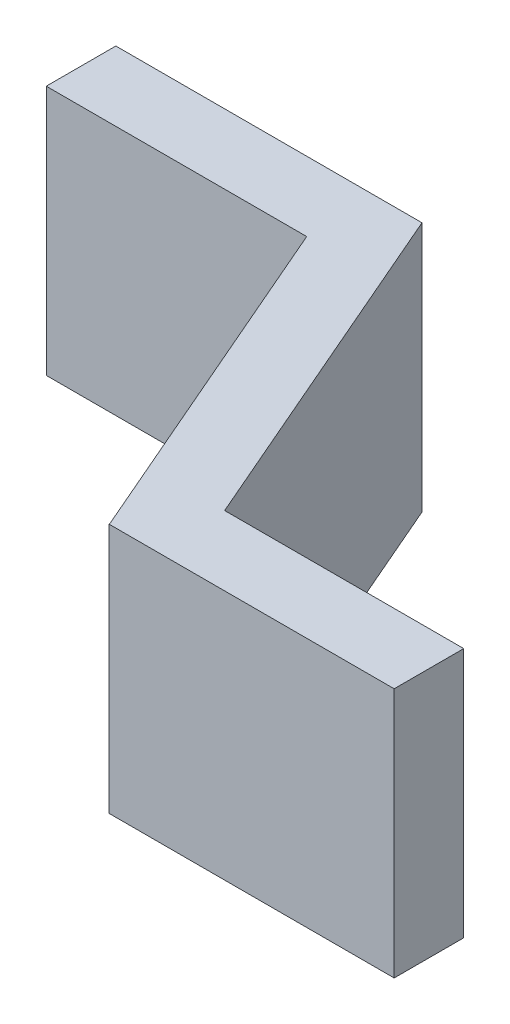
ISO-10303-21;
HEADER;
FILE_DESCRIPTION(('STEP AP214'),'2;1');
FILE_NAME('part.step','',(''),(''),'','','');
FILE_SCHEMA(('AUTOMOTIVE_DESIGN { 1 0 10303 214 1 1 1 1 }'));
ENDSEC;
DATA;
#1=APPLICATION_CONTEXT('core data for automotive mechanical design processes');
#2=APPLICATION_PROTOCOL_DEFINITION('international standard','automotive_design',2000,#1);
#3=PRODUCT_CONTEXT('',#1,'mechanical');
#4=PRODUCT('Part','Part','',(#3));
#5=PRODUCT_RELATED_PRODUCT_CATEGORY('part','',(#4));
#6=PRODUCT_DEFINITION_FORMATION('','',#4);
#7=PRODUCT_DEFINITION_CONTEXT('part definition',#1,'design');
#8=PRODUCT_DEFINITION('design','',#6,#7);
#9=PRODUCT_DEFINITION_SHAPE('','',#8);
#10=(LENGTH_UNIT() NAMED_UNIT(*) SI_UNIT(.MILLI.,.METRE.));
#11=(NAMED_UNIT(*) PLANE_ANGLE_UNIT() SI_UNIT($,.RADIAN.));
#12=(NAMED_UNIT(*) SI_UNIT($,.STERADIAN.) SOLID_ANGLE_UNIT());
#13=UNCERTAINTY_MEASURE_WITH_UNIT(LENGTH_MEASURE(1.E-05),#10,'distance_accuracy_value','');
#14=(GEOMETRIC_REPRESENTATION_CONTEXT(3) GLOBAL_UNCERTAINTY_ASSIGNED_CONTEXT((#13)) GLOBAL_UNIT_ASSIGNED_CONTEXT((#10,
#11,#12)) REPRESENTATION_CONTEXT('',''));
#15=CARTESIAN_POINT('',(0.,0.,0.));
#16=DIRECTION('',(0.,0.,1.));
#17=DIRECTION('',(1.,0.,0.));
#18=AXIS2_PLACEMENT_3D('',#15,#16,#17);
#19=CARTESIAN_POINT('',(0.,1.82,0.));
#20=DIRECTION('',(1.,0.,0.));
#21=DIRECTION('',(0.,0.,-1.));
#22=AXIS2_PLACEMENT_3D('',#19,#20,#21);
#23=PLANE('',#22);
#24=DIRECTION('',(0.,1.,0.));
#25=VECTOR('',#24,1.);
#26=CARTESIAN_POINT('',(0.,1.82,0.));
#27=LINE('',#26,#25);
#28=CARTESIAN_POINT('',(0.,2.180000014305,-1.30339419427667E-10));
#29=VERTEX_POINT('',#28);
#30=CARTESIAN_POINT('',(0.,1.82,-1.556831963824E-10));
#31=VERTEX_POINT('',#30);
#32=EDGE_CURVE('E123',#29,#31,#27,.F.);
#33=ORIENTED_EDGE('',*,*,#32,.T.);
#34=DIRECTION('',(0.,0.,1.));
#35=VECTOR('',#34,1.);
#36=CARTESIAN_POINT('',(0.,1.82,0.));
#37=LINE('',#36,#35);
#38=CARTESIAN_POINT('',(0.,1.82,0.10000000149));
#39=VERTEX_POINT('',#38);
#40=EDGE_CURVE('E115',#31,#39,#37,.T.);
#41=ORIENTED_EDGE('',*,*,#40,.T.);
#42=DIRECTION('',(0.,1.,0.));
#43=VECTOR('',#42,1.);
#44=CARTESIAN_POINT('',(0.,1.82,0.10000000149));
#45=LINE('',#44,#43);
#46=CARTESIAN_POINT('',(0.,2.180000014305,0.10000000149));
#47=VERTEX_POINT('',#46);
#48=EDGE_CURVE('E134',#47,#39,#45,.F.);
#49=ORIENTED_EDGE('',*,*,#48,.F.);
#50=DIRECTION('',(0.,0.,1.));
#51=VECTOR('',#50,1.);
#52=CARTESIAN_POINT('',(0.,2.180000014305,0.));
#53=LINE('',#52,#51);
#54=EDGE_CURVE('E140',#29,#47,#53,.T.);
#55=ORIENTED_EDGE('',*,*,#54,.F.);
#56=EDGE_LOOP('',(#33,#41,#49,#55));
#57=FACE_BOUND('',#56,.T.);
#58=ADVANCED_FACE('F17',(#57),#23,.F.);
#59=CARTESIAN_POINT('',(0.,1.82,0.10000000149));
#60=DIRECTION('',(0.,0.,1.));
#61=DIRECTION('',(1.,0.,0.));
#62=AXIS2_PLACEMENT_3D('',#59,#60,#61);
#63=PLANE('',#62);
#64=DIRECTION('',(0.,1.,0.));
#65=VECTOR('',#64,1.);
#66=CARTESIAN_POINT('',(0.374312226605181,1.82,0.100000001489922));
#67=LINE('',#66,#65);
#68=CARTESIAN_POINT('',(0.37431222660506,2.180000014305,0.100000001489974));
#69=VERTEX_POINT('',#68);
#70=CARTESIAN_POINT('',(0.374312226605091,1.82,0.100000001489974));
#71=VERTEX_POINT('',#70);
#72=EDGE_CURVE('E132',#69,#71,#67,.F.);
#73=ORIENTED_EDGE('',*,*,#72,.F.);
#74=DIRECTION('',(1.,0.,0.));
#75=VECTOR('',#74,1.);
#76=CARTESIAN_POINT('',(0.44,2.180000014305,0.10000000149));
#77=LINE('',#76,#75);
#78=EDGE_CURVE('E137',#47,#69,#77,.T.);
#79=ORIENTED_EDGE('',*,*,#78,.F.);
#80=ORIENTED_EDGE('',*,*,#48,.T.);
#81=DIRECTION('',(1.,0.,0.));
#82=VECTOR('',#81,1.);
#83=CARTESIAN_POINT('',(0.44,1.82,0.10000000149));
#84=LINE('',#83,#82);
#85=EDGE_CURVE('E111',#39,#71,#84,.T.);
#86=ORIENTED_EDGE('',*,*,#85,.T.);
#87=EDGE_LOOP('',(#73,#79,#80,#86));
#88=FACE_BOUND('',#87,.T.);
#89=ADVANCED_FACE('F214',(#88),#63,.T.);
#90=CARTESIAN_POINT('',(0.348224508223,1.82,0.03971472531736));
#91=DIRECTION('',(-0.917754904098641,0.,0.397147247255844));
#92=DIRECTION('',(0.397147247255844,0.,0.917754904098641));
#93=AXIS2_PLACEMENT_3D('',#90,#91,#92);
#94=PLANE('',#93);
#95=DIRECTION('',(0.397147247255413,0.,0.917754904098827));
#96=VECTOR('',#95,1.);
#97=CARTESIAN_POINT('',(0.374312226605,1.82,0.10000000149));
#98=LINE('',#97,#96);
#99=CARTESIAN_POINT('',(0.59,1.82,0.59842599627));
#100=VERTEX_POINT('',#99);
#101=EDGE_CURVE('E110',#71,#100,#98,.T.);
#102=ORIENTED_EDGE('',*,*,#101,.T.);
#103=DIRECTION('',(0.,1.,0.));
#104=VECTOR('',#103,1.);
#105=CARTESIAN_POINT('',(0.59,1.82,0.59842599627));
#106=LINE('',#105,#104);
#107=CARTESIAN_POINT('',(0.59,2.180000014305,0.59842599627));
#108=VERTEX_POINT('',#107);
#109=EDGE_CURVE('E86',#100,#108,#106,.T.);
#110=ORIENTED_EDGE('',*,*,#109,.T.);
#111=DIRECTION('',(0.397147247255413,0.,0.917754904098827));
#112=VECTOR('',#111,1.);
#113=CARTESIAN_POINT('',(0.374312226605,2.180000014305,0.10000000149));
#114=LINE('',#113,#112);
#115=EDGE_CURVE('E139',#69,#108,#114,.T.);
#116=ORIENTED_EDGE('',*,*,#115,.F.);
#117=ORIENTED_EDGE('',*,*,#72,.T.);
#118=EDGE_LOOP('',(#102,#110,#116,#117));
#119=FACE_BOUND('',#118,.T.);
#120=ADVANCED_FACE('F215',(#119),#94,.T.);
#121=CARTESIAN_POINT('',(0.59,1.82,0.5));
#122=DIRECTION('',(1.,0.,0.));
#123=DIRECTION('',(0.,0.,-1.));
#124=AXIS2_PLACEMENT_3D('',#121,#122,#123);
#125=PLANE('',#124);
#126=ORIENTED_EDGE('',*,*,#109,.F.);
#127=DIRECTION('',(0.,0.,-1.));
#128=VECTOR('',#127,1.);
#129=CARTESIAN_POINT('',(0.59,1.82,0.5));
#130=LINE('',#129,#128);
#131=CARTESIAN_POINT('',(0.59,1.82,0.60000000149));
#132=VERTEX_POINT('',#131);
#133=EDGE_CURVE('E20',#100,#132,#130,.F.);
#134=ORIENTED_EDGE('',*,*,#133,.T.);
#135=DIRECTION('',(0.,1.,0.));
#136=VECTOR('',#135,1.);
#137=CARTESIAN_POINT('',(0.59,1.82,0.60000000149));
#138=LINE('',#137,#136);
#139=CARTESIAN_POINT('',(0.59,2.180000014305,0.60000000149));
#140=VERTEX_POINT('',#139);
#141=EDGE_CURVE('E93',#140,#132,#138,.F.);
#142=ORIENTED_EDGE('',*,*,#141,.F.);
#143=DIRECTION('',(0.,0.,1.));
#144=VECTOR('',#143,1.);
#145=CARTESIAN_POINT('',(0.59,2.180000014305,0.));
#146=LINE('',#145,#144);
#147=EDGE_CURVE('E182',#108,#140,#146,.T.);
#148=ORIENTED_EDGE('',*,*,#147,.F.);
#149=EDGE_LOOP('',(#126,#134,#142,#148));
#150=FACE_BOUND('',#149,.T.);
#151=ADVANCED_FACE('F109',(#150),#125,.F.);
#152=CARTESIAN_POINT('',(0.59,1.82,0.60000000149));
#153=DIRECTION('',(0.,0.,1.));
#154=DIRECTION('',(1.,0.,0.));
#155=AXIS2_PLACEMENT_3D('',#152,#153,#154);
#156=PLANE('',#155);
#157=ORIENTED_EDGE('',*,*,#141,.T.);
#158=DIRECTION('',(1.,0.,0.));
#159=VECTOR('',#158,1.);
#160=CARTESIAN_POINT('',(0.44,1.82,0.60000000149));
#161=LINE('',#160,#159);
#162=CARTESIAN_POINT('',(0.999999996424,1.82,0.60000000149));
#163=VERTEX_POINT('',#162);
#164=EDGE_CURVE('E97',#132,#163,#161,.T.);
#165=ORIENTED_EDGE('',*,*,#164,.T.);
#166=DIRECTION('',(0.,1.,0.));
#167=VECTOR('',#166,1.);
#168=CARTESIAN_POINT('',(0.999999996424,1.82,0.60000000149));
#169=LINE('',#168,#167);
#170=CARTESIAN_POINT('',(0.999999996424,2.180000014305,0.60000000149));
#171=VERTEX_POINT('',#170);
#172=EDGE_CURVE('E99',#171,#163,#169,.F.);
#173=ORIENTED_EDGE('',*,*,#172,.F.);
#174=DIRECTION('',(1.,0.,0.));
#175=VECTOR('',#174,1.);
#176=CARTESIAN_POINT('',(0.44,2.180000014305,0.60000000149));
#177=LINE('',#176,#175);
#178=EDGE_CURVE('E98',#140,#171,#177,.T.);
#179=ORIENTED_EDGE('',*,*,#178,.F.);
#180=EDGE_LOOP('',(#157,#165,#173,#179));
#181=FACE_BOUND('',#180,.T.);
#182=ADVANCED_FACE('F95',(#181),#156,.T.);
#183=CARTESIAN_POINT('',(0.999999996424,1.82,0.5));
#184=DIRECTION('',(1.,0.,0.));
#185=DIRECTION('',(0.,0.,-1.));
#186=AXIS2_PLACEMENT_3D('',#183,#184,#185);
#187=PLANE('',#186);
#188=DIRECTION('',(0.,0.,1.));
#189=VECTOR('',#188,1.);
#190=CARTESIAN_POINT('',(0.999999996424,1.82,0.));
#191=LINE('',#190,#189);
#192=CARTESIAN_POINT('',(0.999999996424,1.82,0.5));
#193=VERTEX_POINT('',#192);
#194=EDGE_CURVE('E107',#163,#193,#191,.F.);
#195=ORIENTED_EDGE('',*,*,#194,.T.);
#196=DIRECTION('',(0.,1.,0.));
#197=VECTOR('',#196,1.);
#198=CARTESIAN_POINT('',(0.999999996424,1.82,0.5));
#199=LINE('',#198,#197);
#200=CARTESIAN_POINT('',(0.999999996424,2.180000014305,0.5));
#201=VERTEX_POINT('',#200);
#202=EDGE_CURVE('E192',#193,#201,#199,.T.);
#203=ORIENTED_EDGE('',*,*,#202,.T.);
#204=DIRECTION('',(0.,0.,1.));
#205=VECTOR('',#204,1.);
#206=CARTESIAN_POINT('',(0.999999996424,2.180000014305,0.));
#207=LINE('',#206,#205);
#208=EDGE_CURVE('E126',#171,#201,#207,.F.);
#209=ORIENTED_EDGE('',*,*,#208,.F.);
#210=ORIENTED_EDGE('',*,*,#172,.T.);
#211=EDGE_LOOP('',(#195,#203,#209,#210));
#212=FACE_BOUND('',#211,.T.);
#213=ADVANCED_FACE('F238',(#212),#187,.T.);
#214=CARTESIAN_POINT('',(0.,1.82,0.));
#215=DIRECTION('',(0.,0.,1.));
#216=DIRECTION('',(1.,0.,0.));
#217=AXIS2_PLACEMENT_3D('',#214,#215,#216);
#218=PLANE('',#217);
#219=DIRECTION('',(1.,0.,0.));
#220=VECTOR('',#219,1.);
#221=CARTESIAN_POINT('',(0.44,1.82,-2.335247945736E-10));
#222=LINE('',#221,#220);
#223=CARTESIAN_POINT('',(0.439999999656335,1.82,-3.43069646239979E-10));
#224=VERTEX_POINT('',#223);
#225=EDGE_CURVE('E155',#224,#31,#222,.F.);
#226=ORIENTED_EDGE('',*,*,#225,.T.);
#227=ORIENTED_EDGE('',*,*,#32,.F.);
#228=DIRECTION('',(1.,0.,0.));
#229=VECTOR('',#228,1.);
#230=CARTESIAN_POINT('',(0.44,2.180000014305,-1.955091291415E-10));
#231=LINE('',#230,#229);
#232=CARTESIAN_POINT('',(0.439999999458534,2.180000014305,-1.955091291415E-10));
#233=VERTEX_POINT('',#232);
#234=EDGE_CURVE('E147',#233,#29,#231,.F.);
#235=ORIENTED_EDGE('',*,*,#234,.F.);
#236=DIRECTION('',(0.,1.,0.));
#237=VECTOR('',#236,1.);
#238=CARTESIAN_POINT('',(0.439999999804137,1.82,-4.52614497906357E-10));
#239=LINE('',#238,#237);
#240=EDGE_CURVE('E128',#233,#224,#239,.F.);
#241=ORIENTED_EDGE('',*,*,#240,.T.);
#242=EDGE_LOOP('',(#226,#227,#235,#241));
#243=FACE_BOUND('',#242,.T.);
#244=ADVANCED_FACE('F235',(#243),#218,.F.);
#245=CARTESIAN_POINT('',(0.44,1.82,0.));
#246=DIRECTION('',(0.,1.,0.));
#247=DIRECTION('',(0.,0.,1.));
#248=AXIS2_PLACEMENT_3D('',#245,#246,#247);
#249=PLANE('',#248);
#250=DIRECTION('',(1.,0.,0.));
#251=VECTOR('',#250,1.);
#252=CARTESIAN_POINT('',(0.59,1.82,0.5));
#253=LINE('',#252,#251);
#254=CARTESIAN_POINT('',(0.656368904967001,1.82,0.499999999999999));
#255=VERTEX_POINT('',#254);
#256=EDGE_CURVE('E166',#255,#193,#253,.T.);
#257=ORIENTED_EDGE('',*,*,#256,.T.);
#258=ORIENTED_EDGE('',*,*,#194,.F.);
#259=ORIENTED_EDGE('',*,*,#164,.F.);
#260=ORIENTED_EDGE('',*,*,#133,.F.);
#261=ORIENTED_EDGE('',*,*,#101,.F.);
#262=ORIENTED_EDGE('',*,*,#85,.F.);
#263=ORIENTED_EDGE('',*,*,#40,.F.);
#264=ORIENTED_EDGE('',*,*,#225,.F.);
#265=DIRECTION('',(0.397147247255844,0.,0.917754904098641));
#266=VECTOR('',#265,1.);
#267=CARTESIAN_POINT('',(0.44,1.82,0.));
#268=LINE('',#267,#266);
#269=EDGE_CURVE('E160',#224,#255,#268,.T.);
#270=ORIENTED_EDGE('',*,*,#269,.T.);
#271=EDGE_LOOP('',(#257,#258,#259,#260,#261,#262,#263,#264,#270));
#272=FACE_BOUND('',#271,.T.);
#273=ADVANCED_FACE('F104',(#272),#249,.F.);
#274=CARTESIAN_POINT('',(0.59,1.82,0.5));
#275=DIRECTION('',(0.,0.,1.));
#276=DIRECTION('',(1.,0.,0.));
#277=AXIS2_PLACEMENT_3D('',#274,#275,#276);
#278=PLANE('',#277);
#279=ORIENTED_EDGE('',*,*,#256,.F.);
#280=DIRECTION('',(0.,1.,0.));
#281=VECTOR('',#280,1.);
#282=CARTESIAN_POINT('',(0.656368904967005,1.82,0.499999999999998));
#283=LINE('',#282,#281);
#284=CARTESIAN_POINT('',(0.656368904967001,2.180000014305,0.499999999999999));
#285=VERTEX_POINT('',#284);
#286=EDGE_CURVE('E26',#255,#285,#283,.T.);
#287=ORIENTED_EDGE('',*,*,#286,.T.);
#288=DIRECTION('',(1.,0.,0.));
#289=VECTOR('',#288,1.);
#290=CARTESIAN_POINT('',(0.44,2.180000014305,0.5));
#291=LINE('',#290,#289);
#292=EDGE_CURVE('E34',#201,#285,#291,.F.);
#293=ORIENTED_EDGE('',*,*,#292,.F.);
#294=ORIENTED_EDGE('',*,*,#202,.F.);
#295=EDGE_LOOP('',(#279,#287,#293,#294));
#296=FACE_BOUND('',#295,.T.);
#297=ADVANCED_FACE('F199',(#296),#278,.F.);
#298=CARTESIAN_POINT('',(0.44,2.180000014305,0.));
#299=DIRECTION('',(0.,1.,0.));
#300=DIRECTION('',(0.,0.,1.));
#301=AXIS2_PLACEMENT_3D('',#298,#299,#300);
#302=PLANE('',#301);
#303=ORIENTED_EDGE('',*,*,#178,.T.);
#304=ORIENTED_EDGE('',*,*,#208,.T.);
#305=ORIENTED_EDGE('',*,*,#292,.T.);
#306=DIRECTION('',(0.397147247255844,0.,0.917754904098641));
#307=VECTOR('',#306,1.);
#308=CARTESIAN_POINT('',(0.44,2.180000014305,0.));
#309=LINE('',#308,#307);
#310=EDGE_CURVE('E11',#285,#233,#309,.F.);
#311=ORIENTED_EDGE('',*,*,#310,.T.);
#312=ORIENTED_EDGE('',*,*,#234,.T.);
#313=ORIENTED_EDGE('',*,*,#54,.T.);
#314=ORIENTED_EDGE('',*,*,#78,.T.);
#315=ORIENTED_EDGE('',*,*,#115,.T.);
#316=ORIENTED_EDGE('',*,*,#147,.T.);
#317=EDGE_LOOP('',(#303,#304,#305,#311,#312,#313,#314,#315,#316));
#318=FACE_BOUND('',#317,.T.);
#319=ADVANCED_FACE('F204',(#318),#302,.T.);
#320=CARTESIAN_POINT('',(0.44,1.82,0.));
#321=DIRECTION('',(-0.917754904098641,0.,0.397147247255844));
#322=DIRECTION('',(0.397147247255844,0.,0.917754904098641));
#323=AXIS2_PLACEMENT_3D('',#320,#321,#322);
#324=PLANE('',#323);
#325=ORIENTED_EDGE('',*,*,#286,.F.);
#326=ORIENTED_EDGE('',*,*,#269,.F.);
#327=ORIENTED_EDGE('',*,*,#240,.F.);
#328=ORIENTED_EDGE('',*,*,#310,.F.);
#329=EDGE_LOOP('',(#325,#326,#327,#328));
#330=FACE_BOUND('',#329,.T.);
#331=ADVANCED_FACE('F201',(#330),#324,.F.);
#332=CLOSED_SHELL('',(#58,#89,#120,#151,#182,#213,#244,#273,#297,#319,#331));
#333=MANIFOLD_SOLID_BREP('B1',#332);
#334=ADVANCED_BREP_SHAPE_REPRESENTATION('',(#18,#333),#14);
#335=SHAPE_DEFINITION_REPRESENTATION(#9,#334);
ENDSEC;
END-ISO-10303-21;
